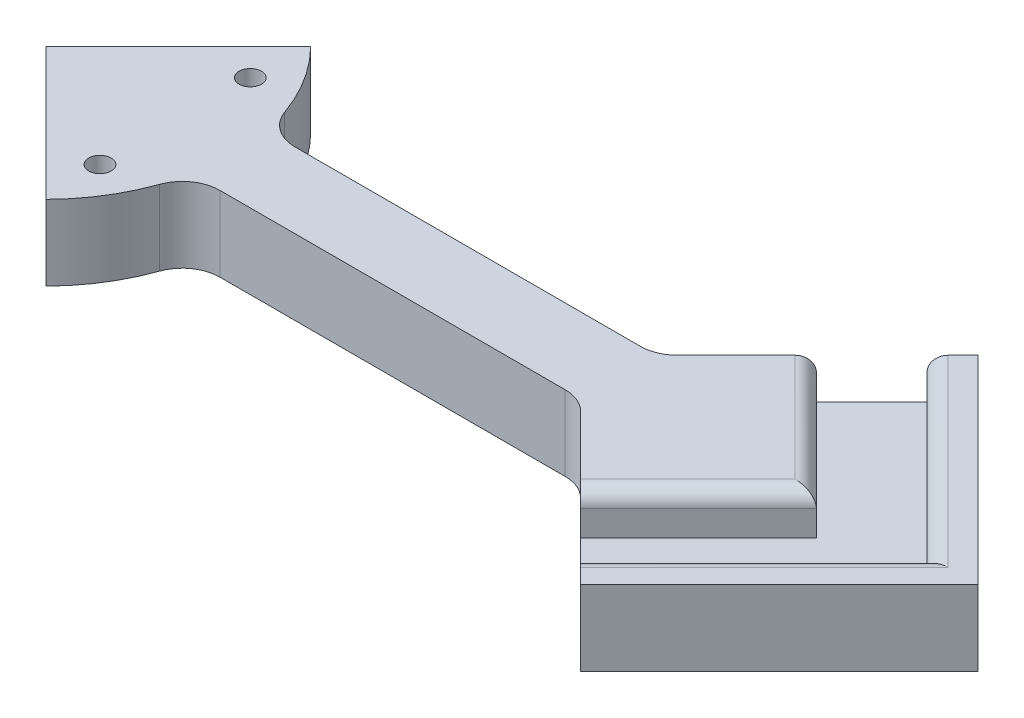
ISO-10303-21;
HEADER;
FILE_DESCRIPTION(('STEP AP214'),'2;1');
FILE_NAME('part.step','',(''),(''),'','','');
FILE_SCHEMA(('AUTOMOTIVE_DESIGN { 1 0 10303 214 1 1 1 1 }'));
ENDSEC;
DATA;
#1=APPLICATION_CONTEXT('core data for automotive mechanical design processes');
#2=APPLICATION_PROTOCOL_DEFINITION('international standard','automotive_design',2000,#1);
#3=PRODUCT_CONTEXT('',#1,'mechanical');
#4=PRODUCT('Part','Part','',(#3));
#5=PRODUCT_RELATED_PRODUCT_CATEGORY('part','',(#4));
#6=PRODUCT_DEFINITION_FORMATION('','',#4);
#7=PRODUCT_DEFINITION_CONTEXT('part definition',#1,'design');
#8=PRODUCT_DEFINITION('design','',#6,#7);
#9=PRODUCT_DEFINITION_SHAPE('','',#8);
#10=(LENGTH_UNIT() NAMED_UNIT(*) SI_UNIT(.MILLI.,.METRE.));
#11=(NAMED_UNIT(*) PLANE_ANGLE_UNIT() SI_UNIT($,.RADIAN.));
#12=(NAMED_UNIT(*) SI_UNIT($,.STERADIAN.) SOLID_ANGLE_UNIT());
#13=UNCERTAINTY_MEASURE_WITH_UNIT(LENGTH_MEASURE(1.E-05),#10,'distance_accuracy_value','');
#14=(GEOMETRIC_REPRESENTATION_CONTEXT(3) GLOBAL_UNCERTAINTY_ASSIGNED_CONTEXT((#13)) GLOBAL_UNIT_ASSIGNED_CONTEXT((#10,
#11,#12)) REPRESENTATION_CONTEXT('',''));
#15=CARTESIAN_POINT('',(0.,0.,0.));
#16=DIRECTION('',(0.,0.,1.));
#17=DIRECTION('',(1.,0.,0.));
#18=AXIS2_PLACEMENT_3D('',#15,#16,#17);
#19=CARTESIAN_POINT('',(0.,12.7,0.));
#20=DIRECTION('',(0.,1.,0.));
#21=DIRECTION('',(0.,0.,1.));
#22=AXIS2_PLACEMENT_3D('',#19,#20,#21);
#23=PLANE('',#22);
#24=CARTESIAN_POINT('',(21.9970452561247,12.7,-12.7));
#25=DIRECTION('',(0.,1.,0.));
#26=DIRECTION('',(0.,0.,1.));
#27=AXIS2_PLACEMENT_3D('',#24,#25,#26);
#28=CIRCLE('',#27,1.90000001);
#29=CARTESIAN_POINT('',(21.9970452561247,12.7,-10.79999999));
#30=VERTEX_POINT('',#29);
#31=EDGE_CURVE('E211',#30,#30,#28,.T.);
#32=ORIENTED_EDGE('',*,*,#31,.F.);
#33=EDGE_LOOP('',(#32));
#34=FACE_BOUND('',#33,.T.);
#35=CARTESIAN_POINT('',(21.9970452561247,12.7,12.7));
#36=DIRECTION('',(0.,1.,0.));
#37=DIRECTION('',(0.,0.,-1.));
#38=AXIS2_PLACEMENT_3D('',#35,#36,#37);
#39=CIRCLE('',#38,1.90000001);
#40=CARTESIAN_POINT('',(21.9970452561247,12.7,10.79999999));
#41=VERTEX_POINT('',#40);
#42=EDGE_CURVE('E319',#41,#41,#39,.T.);
#43=ORIENTED_EDGE('',*,*,#42,.F.);
#44=EDGE_LOOP('',(#43));
#45=FACE_BOUND('',#44,.T.);
#46=DIRECTION('',(0.707106781186547,0.,-0.707106781186548));
#47=VECTOR('',#46,1.);
#48=CARTESIAN_POINT('',(63.3842155928303,12.7,63.3842155928302));
#49=LINE('',#48,#47);
#50=CARTESIAN_POINT('',(108.644706443019,12.7,18.1237247426413));
#51=VERTEX_POINT('',#50);
#52=CARTESIAN_POINT('',(126.76843118566,12.7,0.));
#53=VERTEX_POINT('',#52);
#54=EDGE_CURVE('E307',#51,#53,#49,.T.);
#55=ORIENTED_EDGE('',*,*,#54,.T.);
#56=DIRECTION('',(-0.707106781186547,0.,-0.707106781186548));
#57=VECTOR('',#56,1.);
#58=CARTESIAN_POINT('',(63.3842155928302,12.7,-63.3842155928302));
#59=LINE('',#58,#57);
#60=CARTESIAN_POINT('',(108.644706443019,12.7,-18.1237247426413));
#61=VERTEX_POINT('',#60);
#62=EDGE_CURVE('E309',#53,#61,#59,.T.);
#63=ORIENTED_EDGE('',*,*,#62,.T.);
#64=DIRECTION('',(-0.707106781186548,0.,0.707106781186547));
#65=VECTOR('',#64,1.);
#66=CARTESIAN_POINT('',(90.5209817003778,12.7,0.));
#67=LINE('',#66,#65);
#68=CARTESIAN_POINT('',(98.7308536398429,12.7,-8.20987193946512));
#69=VERTEX_POINT('',#68);
#70=EDGE_CURVE('E240',#61,#69,#67,.T.);
#71=ORIENTED_EDGE('',*,*,#70,.T.);
#72=CARTESIAN_POINT('',(94.2407255793083,12.7,-12.6999999999997));
#73=DIRECTION('',(0.,1.,0.));
#74=DIRECTION('',(0.,0.,1.));
#75=AXIS2_PLACEMENT_3D('',#72,#73,#74);
#76=CIRCLE('',#75,6.35);
#77=CARTESIAN_POINT('',(94.2407255793083,12.7,-6.3499999999997));
#78=VERTEX_POINT('',#77);
#79=EDGE_CURVE('E349',#69,#78,#76,.F.);
#80=ORIENTED_EDGE('',*,*,#79,.T.);
#81=DIRECTION('',(-1.,0.,0.));
#82=VECTOR('',#81,1.);
#83=CARTESIAN_POINT('',(139.879605122423,12.7,-6.3499999999997));
#84=LINE('',#83,#82);
#85=CARTESIAN_POINT('',(35.9210244842767,12.7,-6.34999999999969));
#86=VERTEX_POINT('',#85);
#87=EDGE_CURVE('E268',#78,#86,#84,.T.);
#88=ORIENTED_EDGE('',*,*,#87,.T.);
#89=CARTESIAN_POINT('',(35.9210244842767,12.7,-12.6999999999997));
#90=DIRECTION('',(0.,1.,0.));
#91=DIRECTION('',(0.,0.,1.));
#92=AXIS2_PLACEMENT_3D('',#89,#90,#91);
#93=CIRCLE('',#92,6.35);
#94=CARTESIAN_POINT('',(29.9341870702306,12.7,-10.5833333333331));
#95=VERTEX_POINT('',#94);
#96=EDGE_CURVE('E343',#86,#95,#93,.F.);
#97=ORIENTED_EDGE('',*,*,#96,.T.);
#98=CARTESIAN_POINT('',(0.,12.7,0.));
#99=DIRECTION('',(0.,1.,0.));
#100=DIRECTION('',(0.,0.,1.));
#101=AXIS2_PLACEMENT_3D('',#98,#99,#100);
#102=CIRCLE('',#101,31.75);
#103=CARTESIAN_POINT('',(22.5402632580427,12.7,-22.3606581356213));
#104=VERTEX_POINT('',#103);
#105=EDGE_CURVE('E234',#95,#104,#102,.T.);
#106=ORIENTED_EDGE('',*,*,#105,.T.);
#107=DIRECTION('',(-0.707106781186548,0.,0.707106781186547));
#108=VECTOR('',#107,1.);
#109=CARTESIAN_POINT('',(6.52960512242107,12.7,-6.34999999999969));
#110=LINE('',#109,#108);
#111=CARTESIAN_POINT('',(0.179605122421378,12.7,0.));
#112=VERTEX_POINT('',#111);
#113=EDGE_CURVE('E271',#104,#112,#110,.T.);
#114=ORIENTED_EDGE('',*,*,#113,.T.);
#115=DIRECTION('',(0.707106781186548,0.,0.707106781186547));
#116=VECTOR('',#115,1.);
#117=CARTESIAN_POINT('',(0.179605122421378,12.7,0.));
#118=LINE('',#117,#116);
#119=CARTESIAN_POINT('',(22.5402632580427,12.7,22.3606581356213));
#120=VERTEX_POINT('',#119);
#121=EDGE_CURVE('E274',#112,#120,#118,.T.);
#122=ORIENTED_EDGE('',*,*,#121,.T.);
#123=CARTESIAN_POINT('',(29.9341870702301,12.7,10.5833333333345));
#124=VERTEX_POINT('',#123);
#125=EDGE_CURVE('E230',#120,#124,#102,.T.);
#126=ORIENTED_EDGE('',*,*,#125,.T.);
#127=CARTESIAN_POINT('',(35.9210244842762,12.7,12.7000000000013));
#128=DIRECTION('',(0.,1.,0.));
#129=DIRECTION('',(0.,0.,1.));
#130=AXIS2_PLACEMENT_3D('',#127,#128,#129);
#131=CIRCLE('',#130,6.35);
#132=CARTESIAN_POINT('',(35.9210244842762,12.7,6.35000000000135));
#133=VERTEX_POINT('',#132);
#134=EDGE_CURVE('E345',#124,#133,#131,.F.);
#135=ORIENTED_EDGE('',*,*,#134,.T.);
#136=DIRECTION('',(1.,0.,0.));
#137=VECTOR('',#136,1.);
#138=CARTESIAN_POINT('',(6.52960512242273,12.7,6.35000000000135));
#139=LINE('',#138,#137);
#140=CARTESIAN_POINT('',(94.24072557931,12.7,6.35000000000135));
#141=VERTEX_POINT('',#140);
#142=EDGE_CURVE('E276',#133,#141,#139,.T.);
#143=ORIENTED_EDGE('',*,*,#142,.T.);
#144=CARTESIAN_POINT('',(94.24072557931,12.7,12.7000000000013));
#145=DIRECTION('',(0.,1.,0.));
#146=DIRECTION('',(0.,0.,1.));
#147=AXIS2_PLACEMENT_3D('',#144,#145,#146);
#148=CIRCLE('',#147,6.35);
#149=CARTESIAN_POINT('',(98.7308536398446,12.7,8.20987193946677));
#150=VERTEX_POINT('',#149);
#151=EDGE_CURVE('E11',#141,#150,#148,.F.);
#152=ORIENTED_EDGE('',*,*,#151,.T.);
#153=DIRECTION('',(0.707106781186548,0.,0.707106781186547));
#154=VECTOR('',#153,1.);
#155=CARTESIAN_POINT('',(124.090746971258,12.7,33.5697652708802));
#156=LINE('',#155,#154);
#157=EDGE_CURVE('E258',#150,#51,#156,.T.);
#158=ORIENTED_EDGE('',*,*,#157,.T.);
#159=EDGE_LOOP('',(#55,#63,#71,#80,#88,#97,#106,#114,#122,#126,#135,#143,#152,#158));
#160=FACE_BOUND('',#159,.T.);
#161=ADVANCED_FACE('F37',(#34,#45,#160),#23,.T.);
#162=DIRECTION('',(0.707106781186548,0.,0.707106781186547));
#163=VECTOR('',#162,1.);
#164=CARTESIAN_POINT('',(76.3157844071697,12.7,-76.3157844071698));
#165=LINE('',#164,#163);
#166=CARTESIAN_POINT('',(121.576275257359,12.7,-31.0552935569809));
#167=VERTEX_POINT('',#166);
#168=CARTESIAN_POINT('',(152.63156881434,12.7,0.));
#169=VERTEX_POINT('',#168);
#170=EDGE_CURVE('E289',#167,#169,#165,.T.);
#171=ORIENTED_EDGE('',*,*,#170,.T.);
#172=DIRECTION('',(-0.707106781186547,0.,0.707106781186548));
#173=VECTOR('',#172,1.);
#174=CARTESIAN_POINT('',(76.3157844071698,12.7,76.3157844071698));
#175=LINE('',#174,#173);
#176=CARTESIAN_POINT('',(121.576275257359,12.7,31.0552935569809));
#177=VERTEX_POINT('',#176);
#178=EDGE_CURVE('E291',#169,#177,#175,.T.);
#179=ORIENTED_EDGE('',*,*,#178,.T.);
#180=CARTESIAN_POINT('',(124.090746971258,12.7,33.5697652708802));
#181=VERTEX_POINT('',#180);
#182=EDGE_CURVE('E260',#177,#181,#156,.T.);
#183=ORIENTED_EDGE('',*,*,#182,.T.);
#184=DIRECTION('',(0.707106781186547,0.,-0.707106781186548));
#185=VECTOR('',#184,1.);
#186=CARTESIAN_POINT('',(157.660512242138,12.7,0.));
#187=LINE('',#186,#185);
#188=CARTESIAN_POINT('',(157.660512242138,12.7,0.));
#189=VERTEX_POINT('',#188);
#190=EDGE_CURVE('E255',#181,#189,#187,.T.);
#191=ORIENTED_EDGE('',*,*,#190,.T.);
#192=DIRECTION('',(-0.707106781186547,0.,-0.707106781186548));
#193=VECTOR('',#192,1.);
#194=CARTESIAN_POINT('',(124.090746971258,12.7,-33.5697652708802));
#195=LINE('',#194,#193);
#196=CARTESIAN_POINT('',(124.090746971258,12.7,-33.5697652708802));
#197=VERTEX_POINT('',#196);
#198=EDGE_CURVE('E251',#189,#197,#195,.T.);
#199=ORIENTED_EDGE('',*,*,#198,.T.);
#200=EDGE_CURVE('E261',#197,#167,#67,.T.);
#201=ORIENTED_EDGE('',*,*,#200,.T.);
#202=EDGE_LOOP('',(#171,#179,#183,#191,#199,#201));
#203=FACE_BOUND('',#202,.T.);
#204=ADVANCED_FACE('F402',(#203),#23,.T.);
#205=CARTESIAN_POINT('',(124.090746971258,107.64963466352,33.5697652708802));
#206=DIRECTION('',(0.707106781186547,0.,-0.707106781186548));
#207=DIRECTION('',(-0.707106781186548,0.,-0.707106781186547));
#208=AXIS2_PLACEMENT_3D('',#205,#206,#207);
#209=PLANE('',#208);
#210=ORIENTED_EDGE('',*,*,#157,.F.);
#211=DIRECTION('',(0.,-1.,0.));
#212=VECTOR('',#211,1.);
#213=CARTESIAN_POINT('',(98.7308536398446,0.,8.20987193946677));
#214=LINE('',#213,#212);
#215=CARTESIAN_POINT('',(98.7308536398446,0.,8.20987193946677));
#216=VERTEX_POINT('',#215);
#217=EDGE_CURVE('E339',#150,#216,#214,.T.);
#218=ORIENTED_EDGE('',*,*,#217,.T.);
#219=DIRECTION('',(0.707106781186548,0.,0.707106781186547));
#220=VECTOR('',#219,1.);
#221=CARTESIAN_POINT('',(124.090746971258,0.,33.5697652708802));
#222=LINE('',#221,#220);
#223=CARTESIAN_POINT('',(124.090746971258,0.,33.5697652708802));
#224=VERTEX_POINT('',#223);
#225=EDGE_CURVE('E233',#216,#224,#222,.T.);
#226=ORIENTED_EDGE('',*,*,#225,.T.);
#227=DIRECTION('',(0.,-1.,0.));
#228=VECTOR('',#227,1.);
#229=CARTESIAN_POINT('',(124.090746971258,107.64963466352,33.5697652708802));
#230=LINE('',#229,#228);
#231=EDGE_CURVE('E249',#181,#224,#230,.T.);
#232=ORIENTED_EDGE('',*,*,#231,.F.);
#233=ORIENTED_EDGE('',*,*,#182,.F.);
#234=CARTESIAN_POINT('',(121.576275257359,10.16,31.0552935569809));
#235=DIRECTION('',(0.707106781186547,0.,-0.707106781186548));
#236=DIRECTION('',(-0.707106781186548,0.,-0.707106781186547));
#237=AXIS2_PLACEMENT_3D('',#234,#235,#236);
#238=CIRCLE('',#237,2.54);
#239=CARTESIAN_POINT('',(119.780224033145,10.16,29.2592423327671));
#240=VERTEX_POINT('',#239);
#241=EDGE_CURVE('E297',#177,#240,#238,.F.);
#242=ORIENTED_EDGE('',*,*,#241,.T.);
#243=DIRECTION('',(0.,1.,0.));
#244=VECTOR('',#243,1.);
#245=CARTESIAN_POINT('',(119.780224033145,5.842,29.2592423327671));
#246=LINE('',#245,#244);
#247=CARTESIAN_POINT('',(119.780224033145,5.842,29.2592423327671));
#248=VERTEX_POINT('',#247);
#249=EDGE_CURVE('E415',#248,#240,#246,.T.);
#250=ORIENTED_EDGE('',*,*,#249,.F.);
#251=DIRECTION('',(-0.707106781186548,0.,-0.707106781186548));
#252=VECTOR('',#251,1.);
#253=CARTESIAN_POINT('',(45.2604908501889,5.842,-45.2604908501889));
#254=LINE('',#253,#252);
#255=CARTESIAN_POINT('',(110.440757667233,5.842,19.9197759668551));
#256=VERTEX_POINT('',#255);
#257=EDGE_CURVE('E429',#248,#256,#254,.T.);
#258=ORIENTED_EDGE('',*,*,#257,.T.);
#259=DIRECTION('',(0.,1.,0.));
#260=VECTOR('',#259,1.);
#261=CARTESIAN_POINT('',(110.440757667233,5.842,19.9197759668551));
#262=LINE('',#261,#260);
#263=CARTESIAN_POINT('',(110.440757667233,10.16,19.9197759668551));
#264=VERTEX_POINT('',#263);
#265=EDGE_CURVE('E210',#256,#264,#262,.T.);
#266=ORIENTED_EDGE('',*,*,#265,.T.);
#267=CARTESIAN_POINT('',(108.644706443019,10.16,18.1237247426413));
#268=DIRECTION('',(0.707106781186547,0.,-0.707106781186548));
#269=DIRECTION('',(-0.707106781186548,0.,-0.707106781186547));
#270=AXIS2_PLACEMENT_3D('',#267,#268,#269);
#271=CIRCLE('',#270,2.54);
#272=EDGE_CURVE('E294',#264,#51,#271,.F.);
#273=ORIENTED_EDGE('',*,*,#272,.T.);
#274=EDGE_LOOP('',(#210,#218,#226,#232,#233,#242,#250,#258,#266,#273));
#275=FACE_BOUND('',#274,.T.);
#276=ADVANCED_FACE('F364',(#275),#209,.F.);
#277=CARTESIAN_POINT('',(90.5209817003778,107.64963466352,0.));
#278=DIRECTION('',(0.707106781186547,0.,0.707106781186548));
#279=DIRECTION('',(0.707106781186548,0.,-0.707106781186547));
#280=AXIS2_PLACEMENT_3D('',#277,#278,#279);
#281=PLANE('',#280);
#282=DIRECTION('',(-0.707106781186548,0.,0.707106781186547));
#283=VECTOR('',#282,1.);
#284=CARTESIAN_POINT('',(90.5209817003778,0.,0.));
#285=LINE('',#284,#283);
#286=CARTESIAN_POINT('',(124.090746971258,0.,-33.5697652708802));
#287=VERTEX_POINT('',#286);
#288=CARTESIAN_POINT('',(98.7308536398429,0.,-8.20987193946512));
#289=VERTEX_POINT('',#288);
#290=EDGE_CURVE('E237',#287,#289,#285,.T.);
#291=ORIENTED_EDGE('',*,*,#290,.T.);
#292=DIRECTION('',(0.,1.,0.));
#293=VECTOR('',#292,1.);
#294=CARTESIAN_POINT('',(98.7308536398429,12.7,-8.20987193946512));
#295=LINE('',#294,#293);
#296=EDGE_CURVE('E336',#289,#69,#295,.T.);
#297=ORIENTED_EDGE('',*,*,#296,.T.);
#298=ORIENTED_EDGE('',*,*,#70,.F.);
#299=CARTESIAN_POINT('',(108.644706443019,10.16,-18.1237247426413));
#300=DIRECTION('',(0.707106781186547,0.,0.707106781186548));
#301=DIRECTION('',(0.707106781186548,0.,-0.707106781186547));
#302=AXIS2_PLACEMENT_3D('',#299,#300,#301);
#303=CIRCLE('',#302,2.54);
#304=CARTESIAN_POINT('',(110.440757667233,10.16,-19.9197759668551));
#305=VERTEX_POINT('',#304);
#306=EDGE_CURVE('E303',#61,#305,#303,.F.);
#307=ORIENTED_EDGE('',*,*,#306,.T.);
#308=DIRECTION('',(0.,1.,0.));
#309=VECTOR('',#308,1.);
#310=CARTESIAN_POINT('',(110.440757667233,5.842,-19.9197759668551));
#311=LINE('',#310,#309);
#312=CARTESIAN_POINT('',(110.440757667233,5.842,-19.9197759668551));
#313=VERTEX_POINT('',#312);
#314=EDGE_CURVE('E217',#313,#305,#311,.T.);
#315=ORIENTED_EDGE('',*,*,#314,.F.);
#316=DIRECTION('',(0.707106781186547,0.,-0.707106781186548));
#317=VECTOR('',#316,1.);
#318=CARTESIAN_POINT('',(45.260490850189,5.842,45.2604908501889));
#319=LINE('',#318,#317);
#320=CARTESIAN_POINT('',(119.780224033145,5.842,-29.259242332767));
#321=VERTEX_POINT('',#320);
#322=EDGE_CURVE('E198',#313,#321,#319,.T.);
#323=ORIENTED_EDGE('',*,*,#322,.T.);
#324=DIRECTION('',(0.,1.,0.));
#325=VECTOR('',#324,1.);
#326=CARTESIAN_POINT('',(119.780224033145,5.842,-29.259242332767));
#327=LINE('',#326,#325);
#328=CARTESIAN_POINT('',(119.780224033145,10.16,-29.259242332767));
#329=VERTEX_POINT('',#328);
#330=EDGE_CURVE('E222',#321,#329,#327,.T.);
#331=ORIENTED_EDGE('',*,*,#330,.T.);
#332=CARTESIAN_POINT('',(121.576275257359,10.16,-31.0552935569809));
#333=DIRECTION('',(0.707106781186547,0.,0.707106781186548));
#334=DIRECTION('',(0.707106781186548,0.,-0.707106781186547));
#335=AXIS2_PLACEMENT_3D('',#332,#333,#334);
#336=CIRCLE('',#335,2.54);
#337=EDGE_CURVE('E305',#329,#167,#336,.F.);
#338=ORIENTED_EDGE('',*,*,#337,.T.);
#339=ORIENTED_EDGE('',*,*,#200,.F.);
#340=DIRECTION('',(0.,-1.,0.));
#341=VECTOR('',#340,1.);
#342=CARTESIAN_POINT('',(124.090746971258,107.64963466352,-33.5697652708802));
#343=LINE('',#342,#341);
#344=EDGE_CURVE('E241',#197,#287,#343,.T.);
#345=ORIENTED_EDGE('',*,*,#344,.T.);
#346=EDGE_LOOP('',(#291,#297,#298,#307,#315,#323,#331,#338,#339,#345));
#347=FACE_BOUND('',#346,.T.);
#348=ADVANCED_FACE('F377',(#347),#281,.F.);
#349=CARTESIAN_POINT('',(139.879605122423,12.7,-6.3499999999997));
#350=DIRECTION('',(0.,0.,1.));
#351=DIRECTION('',(1.,0.,0.));
#352=AXIS2_PLACEMENT_3D('',#349,#350,#351);
#353=PLANE('',#352);
#354=DIRECTION('',(-1.,0.,0.));
#355=VECTOR('',#354,1.);
#356=CARTESIAN_POINT('',(139.879605122423,0.,-6.3499999999997));
#357=LINE('',#356,#355);
#358=CARTESIAN_POINT('',(94.2407255793083,0.,-6.3499999999997));
#359=VERTEX_POINT('',#358);
#360=CARTESIAN_POINT('',(35.9210244842767,0.,-6.34999999999969));
#361=VERTEX_POINT('',#360);
#362=EDGE_CURVE('E254',#359,#361,#357,.T.);
#363=ORIENTED_EDGE('',*,*,#362,.T.);
#364=DIRECTION('',(0.,1.,0.));
#365=VECTOR('',#364,1.);
#366=CARTESIAN_POINT('',(35.9210244842767,12.7,-6.34999999999969));
#367=LINE('',#366,#365);
#368=EDGE_CURVE('E327',#361,#86,#367,.T.);
#369=ORIENTED_EDGE('',*,*,#368,.T.);
#370=ORIENTED_EDGE('',*,*,#87,.F.);
#371=DIRECTION('',(0.,1.,0.));
#372=VECTOR('',#371,1.);
#373=CARTESIAN_POINT('',(94.2407255793083,0.,-6.3499999999997));
#374=LINE('',#373,#372);
#375=EDGE_CURVE('E325',#78,#359,#374,.F.);
#376=ORIENTED_EDGE('',*,*,#375,.T.);
#377=EDGE_LOOP('',(#363,#369,#370,#376));
#378=FACE_BOUND('',#377,.T.);
#379=ADVANCED_FACE('F384',(#378),#353,.F.);
#380=CARTESIAN_POINT('',(6.52960512242273,12.7,6.35000000000135));
#381=DIRECTION('',(0.,0.,-1.));
#382=DIRECTION('',(-1.,0.,0.));
#383=AXIS2_PLACEMENT_3D('',#380,#381,#382);
#384=PLANE('',#383);
#385=ORIENTED_EDGE('',*,*,#142,.F.);
#386=DIRECTION('',(0.,1.,0.));
#387=VECTOR('',#386,1.);
#388=CARTESIAN_POINT('',(35.9210244842762,0.,6.35000000000135));
#389=LINE('',#388,#387);
#390=CARTESIAN_POINT('',(35.9210244842762,0.,6.35000000000135));
#391=VERTEX_POINT('',#390);
#392=EDGE_CURVE('E334',#133,#391,#389,.F.);
#393=ORIENTED_EDGE('',*,*,#392,.T.);
#394=DIRECTION('',(1.,0.,0.));
#395=VECTOR('',#394,1.);
#396=CARTESIAN_POINT('',(6.52960512242273,0.,6.35000000000135));
#397=LINE('',#396,#395);
#398=CARTESIAN_POINT('',(94.24072557931,0.,6.35000000000135));
#399=VERTEX_POINT('',#398);
#400=EDGE_CURVE('E272',#391,#399,#397,.T.);
#401=ORIENTED_EDGE('',*,*,#400,.T.);
#402=DIRECTION('',(0.,-1.,0.));
#403=VECTOR('',#402,1.);
#404=CARTESIAN_POINT('',(94.24072557931,12.7,6.35000000000135));
#405=LINE('',#404,#403);
#406=EDGE_CURVE('E332',#399,#141,#405,.F.);
#407=ORIENTED_EDGE('',*,*,#406,.T.);
#408=EDGE_LOOP('',(#385,#393,#401,#407));
#409=FACE_BOUND('',#408,.T.);
#410=ADVANCED_FACE('F361',(#409),#384,.F.);
#411=CARTESIAN_POINT('',(6.52960512242107,12.7,-6.34999999999969));
#412=DIRECTION('',(0.707106781186547,0.,0.707106781186548));
#413=DIRECTION('',(0.707106781186548,0.,-0.707106781186547));
#414=AXIS2_PLACEMENT_3D('',#411,#412,#413);
#415=PLANE('',#414);
#416=DIRECTION('',(-0.707106781186548,0.,0.707106781186547));
#417=VECTOR('',#416,1.);
#418=CARTESIAN_POINT('',(6.52960512242107,0.,-6.34999999999969));
#419=LINE('',#418,#417);
#420=CARTESIAN_POINT('',(22.5402632580427,0.,-22.3606581356213));
#421=VERTEX_POINT('',#420);
#422=CARTESIAN_POINT('',(0.179605122421378,0.,0.));
#423=VERTEX_POINT('',#422);
#424=EDGE_CURVE('E281',#421,#423,#419,.T.);
#425=ORIENTED_EDGE('',*,*,#424,.T.);
#426=DIRECTION('',(0.,-1.,0.));
#427=VECTOR('',#426,1.);
#428=CARTESIAN_POINT('',(0.179605122421378,12.7,0.));
#429=LINE('',#428,#427);
#430=EDGE_CURVE('E278',#112,#423,#429,.T.);
#431=ORIENTED_EDGE('',*,*,#430,.F.);
#432=ORIENTED_EDGE('',*,*,#113,.F.);
#433=DIRECTION('',(0.,-1.,0.));
#434=VECTOR('',#433,1.);
#435=CARTESIAN_POINT('',(22.5402632580427,67.441994499276,-22.3606581356213));
#436=LINE('',#435,#434);
#437=EDGE_CURVE('E229',#104,#421,#436,.T.);
#438=ORIENTED_EDGE('',*,*,#437,.T.);
#439=EDGE_LOOP('',(#425,#431,#432,#438));
#440=FACE_BOUND('',#439,.T.);
#441=ADVANCED_FACE('F469',(#440),#415,.F.);
#442=CARTESIAN_POINT('',(0.179605122421378,12.7,0.));
#443=DIRECTION('',(0.707106781186547,0.,-0.707106781186548));
#444=DIRECTION('',(-0.707106781186548,0.,-0.707106781186547));
#445=AXIS2_PLACEMENT_3D('',#442,#443,#444);
#446=PLANE('',#445);
#447=DIRECTION('',(0.707106781186548,0.,0.707106781186547));
#448=VECTOR('',#447,1.);
#449=CARTESIAN_POINT('',(0.179605122421378,0.,0.));
#450=LINE('',#449,#448);
#451=CARTESIAN_POINT('',(22.5402632580427,0.,22.3606581356213));
#452=VERTEX_POINT('',#451);
#453=EDGE_CURVE('E283',#423,#452,#450,.T.);
#454=ORIENTED_EDGE('',*,*,#453,.T.);
#455=DIRECTION('',(0.,-1.,0.));
#456=VECTOR('',#455,1.);
#457=CARTESIAN_POINT('',(22.5402632580427,67.441994499276,22.3606581356213));
#458=LINE('',#457,#456);
#459=EDGE_CURVE('E216',#120,#452,#458,.T.);
#460=ORIENTED_EDGE('',*,*,#459,.F.);
#461=ORIENTED_EDGE('',*,*,#121,.F.);
#462=ORIENTED_EDGE('',*,*,#430,.T.);
#463=EDGE_LOOP('',(#454,#460,#461,#462));
#464=FACE_BOUND('',#463,.T.);
#465=ADVANCED_FACE('F461',(#464),#446,.F.);
#466=CARTESIAN_POINT('',(0.,0.,0.));
#467=DIRECTION('',(0.,1.,0.));
#468=DIRECTION('',(0.,0.,1.));
#469=AXIS2_PLACEMENT_3D('',#466,#467,#468);
#470=PLANE('',#469);
#471=CARTESIAN_POINT('',(21.9970452561247,0.,-12.7));
#472=DIRECTION('',(0.,1.,0.));
#473=DIRECTION('',(0.,0.,1.));
#474=AXIS2_PLACEMENT_3D('',#471,#472,#473);
#475=CIRCLE('',#474,1.90000001);
#476=CARTESIAN_POINT('',(21.9970452561247,0.,-10.79999999));
#477=VERTEX_POINT('',#476);
#478=EDGE_CURVE('E440',#477,#477,#475,.T.);
#479=ORIENTED_EDGE('',*,*,#478,.T.);
#480=EDGE_LOOP('',(#479));
#481=FACE_BOUND('',#480,.T.);
#482=CARTESIAN_POINT('',(21.9970452561247,0.,12.7));
#483=DIRECTION('',(0.,1.,0.));
#484=DIRECTION('',(0.,0.,-1.));
#485=AXIS2_PLACEMENT_3D('',#482,#483,#484);
#486=CIRCLE('',#485,1.90000001);
#487=CARTESIAN_POINT('',(21.9970452561247,0.,10.79999999));
#488=VERTEX_POINT('',#487);
#489=EDGE_CURVE('E437',#488,#488,#486,.T.);
#490=ORIENTED_EDGE('',*,*,#489,.T.);
#491=EDGE_LOOP('',(#490));
#492=FACE_BOUND('',#491,.T.);
#493=ORIENTED_EDGE('',*,*,#424,.F.);
#494=CARTESIAN_POINT('',(0.,0.,0.));
#495=DIRECTION('',(0.,1.,0.));
#496=DIRECTION('',(0.,0.,1.));
#497=AXIS2_PLACEMENT_3D('',#494,#495,#496);
#498=CIRCLE('',#497,31.75);
#499=CARTESIAN_POINT('',(29.9341870702306,0.,-10.5833333333331));
#500=VERTEX_POINT('',#499);
#501=EDGE_CURVE('E220',#500,#421,#498,.T.);
#502=ORIENTED_EDGE('',*,*,#501,.F.);
#503=CARTESIAN_POINT('',(35.9210244842767,0.,-12.6999999999997));
#504=DIRECTION('',(0.,1.,0.));
#505=DIRECTION('',(0.,0.,1.));
#506=AXIS2_PLACEMENT_3D('',#503,#504,#505);
#507=CIRCLE('',#506,6.35);
#508=EDGE_CURVE('E341',#500,#361,#507,.T.);
#509=ORIENTED_EDGE('',*,*,#508,.T.);
#510=ORIENTED_EDGE('',*,*,#362,.F.);
#511=CARTESIAN_POINT('',(94.2407255793083,0.,-12.6999999999997));
#512=DIRECTION('',(0.,1.,0.));
#513=DIRECTION('',(0.,0.,1.));
#514=AXIS2_PLACEMENT_3D('',#511,#512,#513);
#515=CIRCLE('',#514,6.35);
#516=EDGE_CURVE('E351',#359,#289,#515,.T.);
#517=ORIENTED_EDGE('',*,*,#516,.T.);
#518=ORIENTED_EDGE('',*,*,#290,.F.);
#519=DIRECTION('',(-0.707106781186547,0.,-0.707106781186548));
#520=VECTOR('',#519,1.);
#521=CARTESIAN_POINT('',(124.090746971258,0.,-33.5697652708802));
#522=LINE('',#521,#520);
#523=CARTESIAN_POINT('',(157.660512242138,0.,0.));
#524=VERTEX_POINT('',#523);
#525=EDGE_CURVE('E242',#524,#287,#522,.T.);
#526=ORIENTED_EDGE('',*,*,#525,.F.);
#527=DIRECTION('',(0.707106781186547,0.,-0.707106781186548));
#528=VECTOR('',#527,1.);
#529=CARTESIAN_POINT('',(157.660512242138,0.,0.));
#530=LINE('',#529,#528);
#531=EDGE_CURVE('E246',#224,#524,#530,.T.);
#532=ORIENTED_EDGE('',*,*,#531,.F.);
#533=ORIENTED_EDGE('',*,*,#225,.F.);
#534=CARTESIAN_POINT('',(94.24072557931,0.,12.7000000000013));
#535=DIRECTION('',(0.,1.,0.));
#536=DIRECTION('',(0.,0.,1.));
#537=AXIS2_PLACEMENT_3D('',#534,#535,#536);
#538=CIRCLE('',#537,6.35);
#539=EDGE_CURVE('E45',#216,#399,#538,.T.);
#540=ORIENTED_EDGE('',*,*,#539,.T.);
#541=ORIENTED_EDGE('',*,*,#400,.F.);
#542=CARTESIAN_POINT('',(35.9210244842762,0.,12.7000000000013));
#543=DIRECTION('',(0.,1.,0.));
#544=DIRECTION('',(0.,0.,1.));
#545=AXIS2_PLACEMENT_3D('',#542,#543,#544);
#546=CIRCLE('',#545,6.35);
#547=CARTESIAN_POINT('',(29.9341870702301,0.,10.5833333333345));
#548=VERTEX_POINT('',#547);
#549=EDGE_CURVE('E347',#391,#548,#546,.T.);
#550=ORIENTED_EDGE('',*,*,#549,.T.);
#551=EDGE_CURVE('E226',#452,#548,#498,.T.);
#552=ORIENTED_EDGE('',*,*,#551,.F.);
#553=ORIENTED_EDGE('',*,*,#453,.F.);
#554=EDGE_LOOP('',(#493,#502,#509,#510,#517,#518,#526,#532,#533,#540,#541,#550,#552,#553));
#555=FACE_BOUND('',#554,.T.);
#556=ADVANCED_FACE('F356',(#481,#492,#555),#470,.F.);
#557=CARTESIAN_POINT('',(157.660512242138,107.64963466352,0.));
#558=DIRECTION('',(-0.707106781186548,0.,-0.707106781186547));
#559=DIRECTION('',(-0.707106781186547,0.,0.707106781186548));
#560=AXIS2_PLACEMENT_3D('',#557,#558,#559);
#561=PLANE('',#560);
#562=ORIENTED_EDGE('',*,*,#190,.F.);
#563=ORIENTED_EDGE('',*,*,#231,.T.);
#564=ORIENTED_EDGE('',*,*,#531,.T.);
#565=DIRECTION('',(0.,-1.,0.));
#566=VECTOR('',#565,1.);
#567=CARTESIAN_POINT('',(157.660512242138,107.64963466352,0.));
#568=LINE('',#567,#566);
#569=EDGE_CURVE('E245',#189,#524,#568,.T.);
#570=ORIENTED_EDGE('',*,*,#569,.F.);
#571=EDGE_LOOP('',(#562,#563,#564,#570));
#572=FACE_BOUND('',#571,.T.);
#573=ADVANCED_FACE('F397',(#572),#561,.F.);
#574=CARTESIAN_POINT('',(124.090746971258,107.64963466352,-33.5697652708802));
#575=DIRECTION('',(-0.707106781186548,0.,0.707106781186547));
#576=DIRECTION('',(0.707106781186547,0.,0.707106781186548));
#577=AXIS2_PLACEMENT_3D('',#574,#575,#576);
#578=PLANE('',#577);
#579=ORIENTED_EDGE('',*,*,#198,.F.);
#580=ORIENTED_EDGE('',*,*,#569,.T.);
#581=ORIENTED_EDGE('',*,*,#525,.T.);
#582=ORIENTED_EDGE('',*,*,#344,.F.);
#583=EDGE_LOOP('',(#579,#580,#581,#582));
#584=FACE_BOUND('',#583,.T.);
#585=ADVANCED_FACE('F393',(#584),#578,.F.);
#586=CARTESIAN_POINT('',(0.,67.441994499276,0.));
#587=DIRECTION('',(0.,-1.,0.));
#588=DIRECTION('',(0.,0.,-1.));
#589=AXIS2_PLACEMENT_3D('',#586,#587,#588);
#590=CYLINDRICAL_SURFACE('',#589,31.75);
#591=ORIENTED_EDGE('',*,*,#551,.T.);
#592=DIRECTION('',(0.,-1.,0.));
#593=VECTOR('',#592,1.);
#594=CARTESIAN_POINT('',(29.9341870702301,67.441994499276,10.5833333333345));
#595=LINE('',#594,#593);
#596=EDGE_CURVE('E329',#548,#124,#595,.F.);
#597=ORIENTED_EDGE('',*,*,#596,.T.);
#598=ORIENTED_EDGE('',*,*,#125,.F.);
#599=ORIENTED_EDGE('',*,*,#459,.T.);
#600=EDGE_LOOP('',(#591,#597,#598,#599));
#601=FACE_BOUND('',#600,.T.);
#602=ADVANCED_FACE('F533',(#601),#590,.T.);
#603=ORIENTED_EDGE('',*,*,#105,.F.);
#604=DIRECTION('',(0.,-1.,0.));
#605=VECTOR('',#604,1.);
#606=CARTESIAN_POINT('',(29.9341870702306,67.441994499276,-10.5833333333331));
#607=LINE('',#606,#605);
#608=EDGE_CURVE('E315',#95,#500,#607,.T.);
#609=ORIENTED_EDGE('',*,*,#608,.T.);
#610=ORIENTED_EDGE('',*,*,#501,.T.);
#611=ORIENTED_EDGE('',*,*,#437,.F.);
#612=EDGE_LOOP('',(#603,#609,#610,#611));
#613=FACE_BOUND('',#612,.T.);
#614=ADVANCED_FACE('F528',(#613),#590,.T.);
#615=CARTESIAN_POINT('',(65.1802668170441,5.842,65.180266817044));
#616=DIRECTION('',(0.707106781186548,0.,0.707106781186547));
#617=DIRECTION('',(0.707106781186547,0.,-0.707106781186548));
#618=AXIS2_PLACEMENT_3D('',#615,#616,#617);
#619=PLANE('',#618);
#620=DIRECTION('',(0.,1.,0.));
#621=VECTOR('',#620,1.);
#622=CARTESIAN_POINT('',(130.360533634088,5.842,0.));
#623=LINE('',#622,#621);
#624=CARTESIAN_POINT('',(130.360533634088,5.842,0.));
#625=VERTEX_POINT('',#624);
#626=CARTESIAN_POINT('',(130.360533634088,10.16,0.));
#627=VERTEX_POINT('',#626);
#628=EDGE_CURVE('E207',#625,#627,#623,.T.);
#629=ORIENTED_EDGE('',*,*,#628,.T.);
#630=DIRECTION('',(0.707106781186547,0.,-0.707106781186548));
#631=VECTOR('',#630,1.);
#632=CARTESIAN_POINT('',(65.1802668170441,10.16,65.180266817044));
#633=LINE('',#632,#631);
#634=EDGE_CURVE('E313',#627,#264,#633,.F.);
#635=ORIENTED_EDGE('',*,*,#634,.T.);
#636=ORIENTED_EDGE('',*,*,#265,.F.);
#637=DIRECTION('',(0.707106781186547,0.,-0.707106781186548));
#638=VECTOR('',#637,1.);
#639=CARTESIAN_POINT('',(65.1802668170441,5.842,65.180266817044));
#640=LINE('',#639,#638);
#641=EDGE_CURVE('E195',#256,#625,#640,.T.);
#642=ORIENTED_EDGE('',*,*,#641,.T.);
#643=EDGE_LOOP('',(#629,#635,#636,#642));
#644=FACE_BOUND('',#643,.T.);
#645=ADVANCED_FACE('F206',(#644),#619,.T.);
#646=CARTESIAN_POINT('',(65.1802668170441,5.842,-65.180266817044));
#647=DIRECTION('',(0.707106781186548,0.,-0.707106781186547));
#648=DIRECTION('',(-0.707106781186547,0.,-0.707106781186548));
#649=AXIS2_PLACEMENT_3D('',#646,#647,#648);
#650=PLANE('',#649);
#651=ORIENTED_EDGE('',*,*,#314,.T.);
#652=DIRECTION('',(-0.707106781186547,0.,-0.707106781186548));
#653=VECTOR('',#652,1.);
#654=CARTESIAN_POINT('',(65.1802668170441,10.16,-65.180266817044));
#655=LINE('',#654,#653);
#656=EDGE_CURVE('E215',#305,#627,#655,.F.);
#657=ORIENTED_EDGE('',*,*,#656,.T.);
#658=ORIENTED_EDGE('',*,*,#628,.F.);
#659=DIRECTION('',(-0.707106781186547,0.,-0.707106781186548));
#660=VECTOR('',#659,1.);
#661=CARTESIAN_POINT('',(65.1802668170441,5.842,-65.180266817044));
#662=LINE('',#661,#660);
#663=EDGE_CURVE('E191',#625,#313,#662,.T.);
#664=ORIENTED_EDGE('',*,*,#663,.T.);
#665=EDGE_LOOP('',(#651,#657,#658,#664));
#666=FACE_BOUND('',#665,.T.);
#667=ADVANCED_FACE('F213',(#666),#650,.T.);
#668=CARTESIAN_POINT('',(74.5197331829558,5.842,-74.519733182956));
#669=DIRECTION('',(-0.707106781186547,0.,0.707106781186548));
#670=DIRECTION('',(0.707106781186548,0.,0.707106781186547));
#671=AXIS2_PLACEMENT_3D('',#668,#669,#670);
#672=PLANE('',#671);
#673=DIRECTION('',(0.,1.,0.));
#674=VECTOR('',#673,1.);
#675=CARTESIAN_POINT('',(149.039466365912,5.842,0.));
#676=LINE('',#675,#674);
#677=CARTESIAN_POINT('',(149.039466365912,5.842,0.));
#678=VERTEX_POINT('',#677);
#679=CARTESIAN_POINT('',(149.039466365912,10.16,0.));
#680=VERTEX_POINT('',#679);
#681=EDGE_CURVE('E413',#678,#680,#676,.T.);
#682=ORIENTED_EDGE('',*,*,#681,.T.);
#683=DIRECTION('',(0.707106781186548,0.,0.707106781186547));
#684=VECTOR('',#683,1.);
#685=CARTESIAN_POINT('',(74.5197331829558,10.16,-74.519733182956));
#686=LINE('',#685,#684);
#687=EDGE_CURVE('E301',#680,#329,#686,.F.);
#688=ORIENTED_EDGE('',*,*,#687,.T.);
#689=ORIENTED_EDGE('',*,*,#330,.F.);
#690=DIRECTION('',(0.707106781186548,0.,0.707106781186547));
#691=VECTOR('',#690,1.);
#692=CARTESIAN_POINT('',(74.5197331829558,5.842,-74.519733182956));
#693=LINE('',#692,#691);
#694=EDGE_CURVE('E421',#321,#678,#693,.T.);
#695=ORIENTED_EDGE('',*,*,#694,.T.);
#696=EDGE_LOOP('',(#682,#688,#689,#695));
#697=FACE_BOUND('',#696,.T.);
#698=ADVANCED_FACE('F418',(#697),#672,.T.);
#699=CARTESIAN_POINT('',(74.519733182956,5.842,74.519733182956));
#700=DIRECTION('',(-0.707106781186548,0.,-0.707106781186547));
#701=DIRECTION('',(-0.707106781186547,0.,0.707106781186548));
#702=AXIS2_PLACEMENT_3D('',#699,#700,#701);
#703=PLANE('',#702);
#704=ORIENTED_EDGE('',*,*,#249,.T.);
#705=DIRECTION('',(-0.707106781186547,0.,0.707106781186548));
#706=VECTOR('',#705,1.);
#707=CARTESIAN_POINT('',(74.519733182956,10.16,74.519733182956));
#708=LINE('',#707,#706);
#709=EDGE_CURVE('E299',#240,#680,#708,.F.);
#710=ORIENTED_EDGE('',*,*,#709,.T.);
#711=ORIENTED_EDGE('',*,*,#681,.F.);
#712=DIRECTION('',(-0.707106781186547,0.,0.707106781186548));
#713=VECTOR('',#712,1.);
#714=CARTESIAN_POINT('',(74.519733182956,5.842,74.519733182956));
#715=LINE('',#714,#713);
#716=EDGE_CURVE('E431',#678,#248,#715,.T.);
#717=ORIENTED_EDGE('',*,*,#716,.T.);
#718=EDGE_LOOP('',(#704,#710,#711,#717));
#719=FACE_BOUND('',#718,.T.);
#720=ADVANCED_FACE('F412',(#719),#703,.T.);
#721=CARTESIAN_POINT('',(0.,5.842,0.));
#722=DIRECTION('',(0.,1.,0.));
#723=DIRECTION('',(0.,0.,1.));
#724=AXIS2_PLACEMENT_3D('',#721,#722,#723);
#725=PLANE('',#724);
#726=ORIENTED_EDGE('',*,*,#641,.F.);
#727=ORIENTED_EDGE('',*,*,#257,.F.);
#728=ORIENTED_EDGE('',*,*,#716,.F.);
#729=ORIENTED_EDGE('',*,*,#694,.F.);
#730=ORIENTED_EDGE('',*,*,#322,.F.);
#731=ORIENTED_EDGE('',*,*,#663,.F.);
#732=EDGE_LOOP('',(#726,#727,#728,#729,#730,#731));
#733=FACE_BOUND('',#732,.T.);
#734=ADVANCED_FACE('F193',(#733),#725,.T.);
#735=CARTESIAN_POINT('',(21.9970452561247,12.7,12.7));
#736=DIRECTION('',(0.,-1.,0.));
#737=DIRECTION('',(0.,0.,-1.));
#738=AXIS2_PLACEMENT_3D('',#735,#736,#737);
#739=CYLINDRICAL_SURFACE('',#738,1.90000001);
#740=ORIENTED_EDGE('',*,*,#42,.T.);
#741=EDGE_LOOP('',(#740));
#742=FACE_BOUND('',#741,.T.);
#743=ORIENTED_EDGE('',*,*,#489,.F.);
#744=EDGE_LOOP('',(#743));
#745=FACE_BOUND('',#744,.T.);
#746=ADVANCED_FACE('F454',(#742,#745),#739,.F.);
#747=CARTESIAN_POINT('',(21.9970452561247,12.7,-12.7));
#748=DIRECTION('',(0.,-1.,0.));
#749=DIRECTION('',(0.,0.,-1.));
#750=AXIS2_PLACEMENT_3D('',#747,#748,#749);
#751=CYLINDRICAL_SURFACE('',#750,1.90000001);
#752=ORIENTED_EDGE('',*,*,#31,.T.);
#753=EDGE_LOOP('',(#752));
#754=FACE_BOUND('',#753,.T.);
#755=ORIENTED_EDGE('',*,*,#478,.F.);
#756=EDGE_LOOP('',(#755));
#757=FACE_BOUND('',#756,.T.);
#758=ADVANCED_FACE('F446',(#754,#757),#751,.F.);
#759=CARTESIAN_POINT('',(76.3157844071697,10.16,-76.3157844071698));
#760=DIRECTION('',(0.707106781186548,0.,0.707106781186547));
#761=DIRECTION('',(0.707106781186547,0.,-0.707106781186548));
#762=AXIS2_PLACEMENT_3D('',#759,#760,#761);
#763=CYLINDRICAL_SURFACE('',#762,2.54);
#764=ORIENTED_EDGE('',*,*,#337,.F.);
#765=ORIENTED_EDGE('',*,*,#687,.F.);
#766=CARTESIAN_POINT('',(152.63156881434,10.16,0.));
#767=DIRECTION('',(0.,0.,1.));
#768=DIRECTION('',(-1.,0.,0.));
#769=AXIS2_PLACEMENT_3D('',#766,#767,#768);
#770=ELLIPSE('',#769,3.59210244842766,2.54);
#771=EDGE_CURVE('E316',#169,#680,#770,.T.);
#772=ORIENTED_EDGE('',*,*,#771,.F.);
#773=ORIENTED_EDGE('',*,*,#170,.F.);
#774=EDGE_LOOP('',(#764,#765,#772,#773));
#775=FACE_BOUND('',#774,.T.);
#776=ADVANCED_FACE('F425',(#775),#763,.T.);
#777=CARTESIAN_POINT('',(76.3157844071698,10.16,76.3157844071698));
#778=DIRECTION('',(-0.707106781186547,0.,0.707106781186548));
#779=DIRECTION('',(0.707106781186548,0.,0.707106781186547));
#780=AXIS2_PLACEMENT_3D('',#777,#778,#779);
#781=CYLINDRICAL_SURFACE('',#780,2.54);
#782=ORIENTED_EDGE('',*,*,#771,.T.);
#783=ORIENTED_EDGE('',*,*,#709,.F.);
#784=ORIENTED_EDGE('',*,*,#241,.F.);
#785=ORIENTED_EDGE('',*,*,#178,.F.);
#786=EDGE_LOOP('',(#782,#783,#784,#785));
#787=FACE_BOUND('',#786,.T.);
#788=ADVANCED_FACE('F407',(#787),#781,.T.);
#789=CARTESIAN_POINT('',(63.3842155928303,10.16,63.3842155928302));
#790=DIRECTION('',(0.707106781186547,0.,-0.707106781186548));
#791=DIRECTION('',(-0.707106781186548,0.,-0.707106781186547));
#792=AXIS2_PLACEMENT_3D('',#789,#790,#791);
#793=CYLINDRICAL_SURFACE('',#792,2.54);
#794=ORIENTED_EDGE('',*,*,#272,.F.);
#795=ORIENTED_EDGE('',*,*,#634,.F.);
#796=CARTESIAN_POINT('',(126.76843118566,10.16,0.));
#797=DIRECTION('',(0.,0.,-1.));
#798=DIRECTION('',(1.,0.,0.));
#799=AXIS2_PLACEMENT_3D('',#796,#797,#798);
#800=ELLIPSE('',#799,3.59210244842766,2.54);
#801=EDGE_CURVE('E320',#53,#627,#800,.T.);
#802=ORIENTED_EDGE('',*,*,#801,.F.);
#803=ORIENTED_EDGE('',*,*,#54,.F.);
#804=EDGE_LOOP('',(#794,#795,#802,#803));
#805=FACE_BOUND('',#804,.T.);
#806=ADVANCED_FACE('F373',(#805),#793,.T.);
#807=CARTESIAN_POINT('',(63.3842155928302,10.16,-63.3842155928302));
#808=DIRECTION('',(-0.707106781186547,0.,-0.707106781186548));
#809=DIRECTION('',(-0.707106781186548,0.,0.707106781186547));
#810=AXIS2_PLACEMENT_3D('',#807,#808,#809);
#811=CYLINDRICAL_SURFACE('',#810,2.54);
#812=ORIENTED_EDGE('',*,*,#801,.T.);
#813=ORIENTED_EDGE('',*,*,#656,.F.);
#814=ORIENTED_EDGE('',*,*,#306,.F.);
#815=ORIENTED_EDGE('',*,*,#62,.F.);
#816=EDGE_LOOP('',(#812,#813,#814,#815));
#817=FACE_BOUND('',#816,.T.);
#818=ADVANCED_FACE('F375',(#817),#811,.T.);
#819=CARTESIAN_POINT('',(35.9210244842767,67.441994499276,-12.6999999999997));
#820=DIRECTION('',(0.,-1.,0.));
#821=DIRECTION('',(0.,0.,-1.));
#822=AXIS2_PLACEMENT_3D('',#819,#820,#821);
#823=CYLINDRICAL_SURFACE('',#822,6.35);
#824=ORIENTED_EDGE('',*,*,#96,.F.);
#825=ORIENTED_EDGE('',*,*,#368,.F.);
#826=ORIENTED_EDGE('',*,*,#508,.F.);
#827=ORIENTED_EDGE('',*,*,#608,.F.);
#828=EDGE_LOOP('',(#824,#825,#826,#827));
#829=FACE_BOUND('',#828,.T.);
#830=ADVANCED_FACE('F487',(#829),#823,.F.);
#831=CARTESIAN_POINT('',(35.9210244842762,67.441994499276,12.7000000000013));
#832=DIRECTION('',(0.,-1.,0.));
#833=DIRECTION('',(0.,0.,-1.));
#834=AXIS2_PLACEMENT_3D('',#831,#832,#833);
#835=CYLINDRICAL_SURFACE('',#834,6.35);
#836=ORIENTED_EDGE('',*,*,#549,.F.);
#837=ORIENTED_EDGE('',*,*,#392,.F.);
#838=ORIENTED_EDGE('',*,*,#134,.F.);
#839=ORIENTED_EDGE('',*,*,#596,.F.);
#840=EDGE_LOOP('',(#836,#837,#838,#839));
#841=FACE_BOUND('',#840,.T.);
#842=ADVANCED_FACE('F492',(#841),#835,.F.);
#843=CARTESIAN_POINT('',(94.2407255793083,107.64963466352,-12.6999999999997));
#844=DIRECTION('',(0.,-1.,0.));
#845=DIRECTION('',(0.,0.,-1.));
#846=AXIS2_PLACEMENT_3D('',#843,#844,#845);
#847=CYLINDRICAL_SURFACE('',#846,6.35);
#848=ORIENTED_EDGE('',*,*,#516,.F.);
#849=ORIENTED_EDGE('',*,*,#375,.F.);
#850=ORIENTED_EDGE('',*,*,#79,.F.);
#851=ORIENTED_EDGE('',*,*,#296,.F.);
#852=EDGE_LOOP('',(#848,#849,#850,#851));
#853=FACE_BOUND('',#852,.T.);
#854=ADVANCED_FACE('F388',(#853),#847,.F.);
#855=CARTESIAN_POINT('',(94.24072557931,107.64963466352,12.7000000000013));
#856=DIRECTION('',(0.,1.,0.));
#857=DIRECTION('',(0.,0.,1.));
#858=AXIS2_PLACEMENT_3D('',#855,#856,#857);
#859=CYLINDRICAL_SURFACE('',#858,6.35);
#860=ORIENTED_EDGE('',*,*,#151,.F.);
#861=ORIENTED_EDGE('',*,*,#406,.F.);
#862=ORIENTED_EDGE('',*,*,#539,.F.);
#863=ORIENTED_EDGE('',*,*,#217,.F.);
#864=EDGE_LOOP('',(#860,#861,#862,#863));
#865=FACE_BOUND('',#864,.T.);
#866=ADVANCED_FACE('F39',(#865),#859,.F.);
#867=CLOSED_SHELL('',(#161,#204,#276,#348,#379,#410,#441,#465,#556,#573,#585,#602,#614,#645,
#667,#698,#720,#734,#746,#758,#776,#788,#806,#818,#830,#842,#854,#866));
#868=MANIFOLD_SOLID_BREP('B2',#867);
#869=ADVANCED_BREP_SHAPE_REPRESENTATION('',(#18,#868),#14);
#870=SHAPE_DEFINITION_REPRESENTATION(#9,#869);
ENDSEC;
END-ISO-10303-21;
